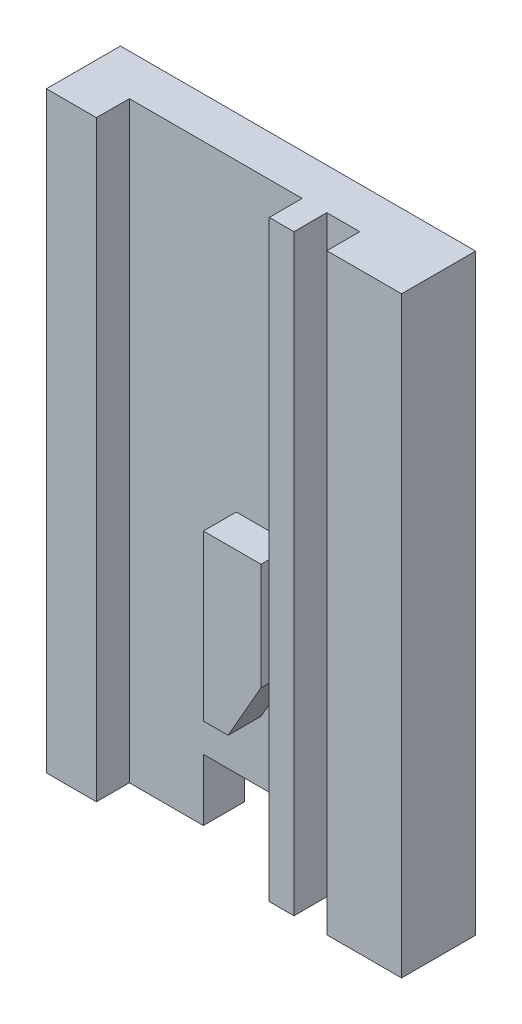
ISO-10303-21;
HEADER;
FILE_DESCRIPTION(('STEP AP214'),'2;1');
FILE_NAME('part.step','',(''),(''),'','','');
FILE_SCHEMA(('AUTOMOTIVE_DESIGN { 1 0 10303 214 1 1 1 1 }'));
ENDSEC;
DATA;
#1=APPLICATION_CONTEXT('core data for automotive mechanical design processes');
#2=APPLICATION_PROTOCOL_DEFINITION('international standard','automotive_design',2000,#1);
#3=PRODUCT_CONTEXT('',#1,'mechanical');
#4=PRODUCT('Part','Part','',(#3));
#5=PRODUCT_RELATED_PRODUCT_CATEGORY('part','',(#4));
#6=PRODUCT_DEFINITION_FORMATION('','',#4);
#7=PRODUCT_DEFINITION_CONTEXT('part definition',#1,'design');
#8=PRODUCT_DEFINITION('design','',#6,#7);
#9=PRODUCT_DEFINITION_SHAPE('','',#8);
#10=(LENGTH_UNIT() NAMED_UNIT(*) SI_UNIT(.MILLI.,.METRE.));
#11=(NAMED_UNIT(*) PLANE_ANGLE_UNIT() SI_UNIT($,.RADIAN.));
#12=(NAMED_UNIT(*) SI_UNIT($,.STERADIAN.) SOLID_ANGLE_UNIT());
#13=UNCERTAINTY_MEASURE_WITH_UNIT(LENGTH_MEASURE(1.E-05),#10,'distance_accuracy_value','');
#14=(GEOMETRIC_REPRESENTATION_CONTEXT(3) GLOBAL_UNCERTAINTY_ASSIGNED_CONTEXT((#13)) GLOBAL_UNIT_ASSIGNED_CONTEXT((#10,
#11,#12)) REPRESENTATION_CONTEXT('',''));
#15=CARTESIAN_POINT('',(0.,0.,0.));
#16=DIRECTION('',(0.,0.,1.));
#17=DIRECTION('',(1.,0.,0.));
#18=AXIS2_PLACEMENT_3D('',#15,#16,#17);
#19=CARTESIAN_POINT('',(1.,-11.,9.));
#20=DIRECTION('',(0.,0.,1.));
#21=DIRECTION('',(1.,0.,0.));
#22=AXIS2_PLACEMENT_3D('',#19,#20,#21);
#23=PLANE('',#22);
#24=DIRECTION('',(0.,1.,0.));
#25=VECTOR('',#24,1.);
#26=CARTESIAN_POINT('',(-2.5,-21.,9.));
#27=LINE('',#26,#25);
#28=CARTESIAN_POINT('',(-2.5,-21.,9.));
#29=VERTEX_POINT('',#28);
#30=CARTESIAN_POINT('',(-2.5,-0.999999999999997,9.));
#31=VERTEX_POINT('',#30);
#32=EDGE_CURVE('E19',#29,#31,#27,.T.);
#33=ORIENTED_EDGE('',*,*,#32,.F.);
#34=DIRECTION('',(1.,0.,0.));
#35=VECTOR('',#34,1.);
#36=CARTESIAN_POINT('',(4.50000000000001,-21.,9.));
#37=LINE('',#36,#35);
#38=CARTESIAN_POINT('',(0.500000000000006,-21.,9.));
#39=VERTEX_POINT('',#38);
#40=EDGE_CURVE('E183',#39,#29,#37,.F.);
#41=ORIENTED_EDGE('',*,*,#40,.F.);
#42=DIRECTION('',(0.496138938356833,0.86824314212446,0.));
#43=VECTOR('',#42,1.);
#44=CARTESIAN_POINT('',(2.5,-17.5,9.));
#45=LINE('',#44,#43);
#46=CARTESIAN_POINT('',(4.5,-14.,9.));
#47=VERTEX_POINT('',#46);
#48=EDGE_CURVE('E175',#47,#39,#45,.F.);
#49=ORIENTED_EDGE('',*,*,#48,.F.);
#50=DIRECTION('',(0.,1.,0.));
#51=VECTOR('',#50,1.);
#52=CARTESIAN_POINT('',(4.5,-0.999999999999996,9.));
#53=LINE('',#52,#51);
#54=CARTESIAN_POINT('',(4.5,-0.999999999999997,9.));
#55=VERTEX_POINT('',#54);
#56=EDGE_CURVE('E169',#55,#47,#53,.F.);
#57=ORIENTED_EDGE('',*,*,#56,.F.);
#58=DIRECTION('',(1.,0.,0.));
#59=VECTOR('',#58,1.);
#60=CARTESIAN_POINT('',(-2.5,-0.999999999999998,9.));
#61=LINE('',#60,#59);
#62=EDGE_CURVE('E151',#31,#55,#61,.T.);
#63=ORIENTED_EDGE('',*,*,#62,.F.);
#64=EDGE_LOOP('',(#33,#41,#49,#57,#63));
#65=FACE_BOUND('',#64,.T.);
#66=ADVANCED_FACE('F16',(#65),#23,.T.);
#67=CARTESIAN_POINT('',(-2.5,-21.,0.));
#68=DIRECTION('',(-1.,0.,0.));
#69=DIRECTION('',(0.,0.,1.));
#70=AXIS2_PLACEMENT_3D('',#67,#68,#69);
#71=PLANE('',#70);
#72=ORIENTED_EDGE('',*,*,#32,.T.);
#73=DIRECTION('',(0.,0.,1.));
#74=VECTOR('',#73,1.);
#75=CARTESIAN_POINT('',(-2.5,-0.999999999999998,0.));
#76=LINE('',#75,#74);
#77=CARTESIAN_POINT('',(-2.5,-0.999999999999998,5.));
#78=VERTEX_POINT('',#77);
#79=EDGE_CURVE('E160',#78,#31,#76,.T.);
#80=ORIENTED_EDGE('',*,*,#79,.F.);
#81=DIRECTION('',(0.,1.,0.));
#82=VECTOR('',#81,1.);
#83=CARTESIAN_POINT('',(-2.5,0.,5.));
#84=LINE('',#83,#82);
#85=CARTESIAN_POINT('',(-2.5,-21.,5.));
#86=VERTEX_POINT('',#85);
#87=EDGE_CURVE('E200',#86,#78,#84,.T.);
#88=ORIENTED_EDGE('',*,*,#87,.F.);
#89=DIRECTION('',(0.,0.,-1.));
#90=VECTOR('',#89,1.);
#91=CARTESIAN_POINT('',(-2.5,-21.,0.));
#92=LINE('',#91,#90);
#93=EDGE_CURVE('E162',#29,#86,#92,.T.);
#94=ORIENTED_EDGE('',*,*,#93,.F.);
#95=EDGE_LOOP('',(#72,#80,#88,#94));
#96=FACE_BOUND('',#95,.T.);
#97=ADVANCED_FACE('F158',(#96),#71,.T.);
#98=CARTESIAN_POINT('',(-2.5,-0.999999999999998,0.));
#99=DIRECTION('',(0.,1.,0.));
#100=DIRECTION('',(0.,0.,1.));
#101=AXIS2_PLACEMENT_3D('',#98,#99,#100);
#102=PLANE('',#101);
#103=ORIENTED_EDGE('',*,*,#62,.T.);
#104=DIRECTION('',(0.,0.,-1.));
#105=VECTOR('',#104,1.);
#106=CARTESIAN_POINT('',(4.5,-0.999999999999996,0.));
#107=LINE('',#106,#105);
#108=CARTESIAN_POINT('',(4.5,-0.999999999999997,5.));
#109=VERTEX_POINT('',#108);
#110=EDGE_CURVE('E170',#109,#55,#107,.F.);
#111=ORIENTED_EDGE('',*,*,#110,.F.);
#112=DIRECTION('',(1.,0.,0.));
#113=VECTOR('',#112,1.);
#114=CARTESIAN_POINT('',(-17.,-0.999999999999998,5.));
#115=LINE('',#114,#113);
#116=EDGE_CURVE('E166',#78,#109,#115,.T.);
#117=ORIENTED_EDGE('',*,*,#116,.F.);
#118=ORIENTED_EDGE('',*,*,#79,.T.);
#119=EDGE_LOOP('',(#103,#111,#117,#118));
#120=FACE_BOUND('',#119,.T.);
#121=ADVANCED_FACE('F165',(#120),#102,.T.);
#122=CARTESIAN_POINT('',(4.5,-0.999999999999996,0.));
#123=DIRECTION('',(1.,0.,0.));
#124=DIRECTION('',(0.,0.,-1.));
#125=AXIS2_PLACEMENT_3D('',#122,#123,#124);
#126=PLANE('',#125);
#127=ORIENTED_EDGE('',*,*,#110,.T.);
#128=ORIENTED_EDGE('',*,*,#56,.T.);
#129=DIRECTION('',(0.,0.,1.));
#130=VECTOR('',#129,1.);
#131=CARTESIAN_POINT('',(4.5,-14.,0.));
#132=LINE('',#131,#130);
#133=CARTESIAN_POINT('',(4.5,-14.,5.));
#134=VERTEX_POINT('',#133);
#135=EDGE_CURVE('E177',#134,#47,#132,.T.);
#136=ORIENTED_EDGE('',*,*,#135,.F.);
#137=DIRECTION('',(0.,1.,0.));
#138=VECTOR('',#137,1.);
#139=CARTESIAN_POINT('',(4.5,0.,5.));
#140=LINE('',#139,#138);
#141=EDGE_CURVE('E203',#109,#134,#140,.F.);
#142=ORIENTED_EDGE('',*,*,#141,.F.);
#143=EDGE_LOOP('',(#127,#128,#136,#142));
#144=FACE_BOUND('',#143,.T.);
#145=ADVANCED_FACE('F400',(#144),#126,.T.);
#146=CARTESIAN_POINT('',(2.5,-17.5,0.));
#147=DIRECTION('',(0.86824314212446,-0.496138938356833,0.));
#148=DIRECTION('',(0.496138938356833,0.86824314212446,0.));
#149=AXIS2_PLACEMENT_3D('',#146,#147,#148);
#150=PLANE('',#149);
#151=DIRECTION('',(-0.496138938356834,-0.868243142124459,0.));
#152=VECTOR('',#151,1.);
#153=CARTESIAN_POINT('',(4.5,-14.,5.));
#154=LINE('',#153,#152);
#155=CARTESIAN_POINT('',(0.500000000000006,-21.,5.));
#156=VERTEX_POINT('',#155);
#157=EDGE_CURVE('E205',#134,#156,#154,.T.);
#158=ORIENTED_EDGE('',*,*,#157,.F.);
#159=ORIENTED_EDGE('',*,*,#135,.T.);
#160=ORIENTED_EDGE('',*,*,#48,.T.);
#161=DIRECTION('',(0.,0.,-1.));
#162=VECTOR('',#161,1.);
#163=CARTESIAN_POINT('',(0.500000000000005,-21.,0.));
#164=LINE('',#163,#162);
#165=EDGE_CURVE('E180',#156,#39,#164,.F.);
#166=ORIENTED_EDGE('',*,*,#165,.F.);
#167=EDGE_LOOP('',(#158,#159,#160,#166));
#168=FACE_BOUND('',#167,.T.);
#169=ADVANCED_FACE('F396',(#168),#150,.T.);
#170=CARTESIAN_POINT('',(4.50000000000001,-21.,0.));
#171=DIRECTION('',(0.,-1.,0.));
#172=DIRECTION('',(0.,0.,-1.));
#173=AXIS2_PLACEMENT_3D('',#170,#171,#172);
#174=PLANE('',#173);
#175=ORIENTED_EDGE('',*,*,#93,.T.);
#176=DIRECTION('',(1.,0.,0.));
#177=VECTOR('',#176,1.);
#178=CARTESIAN_POINT('',(-17.,-21.,5.));
#179=LINE('',#178,#177);
#180=EDGE_CURVE('E207',#156,#86,#179,.F.);
#181=ORIENTED_EDGE('',*,*,#180,.F.);
#182=ORIENTED_EDGE('',*,*,#165,.T.);
#183=ORIENTED_EDGE('',*,*,#40,.T.);
#184=EDGE_LOOP('',(#175,#181,#182,#183));
#185=FACE_BOUND('',#184,.T.);
#186=ADVANCED_FACE('F392',(#185),#174,.T.);
#187=CARTESIAN_POINT('',(9.,0.,9.));
#188=DIRECTION('',(0.,0.,1.));
#189=DIRECTION('',(1.,0.,0.));
#190=AXIS2_PLACEMENT_3D('',#187,#188,#189);
#191=PLANE('',#190);
#192=DIRECTION('',(0.,1.,0.));
#193=VECTOR('',#192,1.);
#194=CARTESIAN_POINT('',(5.50000000000001,-36.,9.));
#195=LINE('',#194,#193);
#196=CARTESIAN_POINT('',(5.50000000000001,-36.,9.));
#197=VERTEX_POINT('',#196);
#198=CARTESIAN_POINT('',(5.5,36.,9.));
#199=VERTEX_POINT('',#198);
#200=EDGE_CURVE('E213',#197,#199,#195,.T.);
#201=ORIENTED_EDGE('',*,*,#200,.F.);
#202=DIRECTION('',(1.,0.,0.));
#203=VECTOR('',#202,1.);
#204=CARTESIAN_POINT('',(12.5,-36.,9.));
#205=LINE('',#204,#203);
#206=CARTESIAN_POINT('',(8.50000000000001,-36.,9.));
#207=VERTEX_POINT('',#206);
#208=EDGE_CURVE('E233',#207,#197,#205,.F.);
#209=ORIENTED_EDGE('',*,*,#208,.F.);
#210=DIRECTION('',(0.,1.,0.));
#211=VECTOR('',#210,1.);
#212=CARTESIAN_POINT('',(8.50000000000001,-36.,9.));
#213=LINE('',#212,#211);
#214=CARTESIAN_POINT('',(8.5,36.,9.));
#215=VERTEX_POINT('',#214);
#216=EDGE_CURVE('E186',#207,#215,#213,.T.);
#217=ORIENTED_EDGE('',*,*,#216,.T.);
#218=DIRECTION('',(1.,0.,0.));
#219=VECTOR('',#218,1.);
#220=CARTESIAN_POINT('',(-18.5,36.,9.));
#221=LINE('',#220,#219);
#222=EDGE_CURVE('E250',#199,#215,#221,.T.);
#223=ORIENTED_EDGE('',*,*,#222,.F.);
#224=EDGE_LOOP('',(#201,#209,#217,#223));
#225=FACE_BOUND('',#224,.T.);
#226=ADVANCED_FACE('F388',(#225),#191,.T.);
#227=CARTESIAN_POINT('',(8.50000000000001,-36.,0.));
#228=DIRECTION('',(-1.,0.,0.));
#229=DIRECTION('',(0.,0.,1.));
#230=AXIS2_PLACEMENT_3D('',#227,#228,#229);
#231=PLANE('',#230);
#232=DIRECTION('',(0.,0.,1.));
#233=VECTOR('',#232,1.);
#234=CARTESIAN_POINT('',(8.49999999999999,36.,0.));
#235=LINE('',#234,#233);
#236=CARTESIAN_POINT('',(8.5,36.,5.));
#237=VERTEX_POINT('',#236);
#238=EDGE_CURVE('E252',#215,#237,#235,.F.);
#239=ORIENTED_EDGE('',*,*,#238,.F.);
#240=ORIENTED_EDGE('',*,*,#216,.F.);
#241=DIRECTION('',(0.,0.,-1.));
#242=VECTOR('',#241,1.);
#243=CARTESIAN_POINT('',(8.50000000000001,-36.,0.));
#244=LINE('',#243,#242);
#245=CARTESIAN_POINT('',(8.5,-36.,5.));
#246=VERTEX_POINT('',#245);
#247=EDGE_CURVE('E230',#246,#207,#244,.F.);
#248=ORIENTED_EDGE('',*,*,#247,.F.);
#249=DIRECTION('',(0.,1.,0.));
#250=VECTOR('',#249,1.);
#251=CARTESIAN_POINT('',(8.49999999999999,0.,5.));
#252=LINE('',#251,#250);
#253=EDGE_CURVE('E189',#237,#246,#252,.F.);
#254=ORIENTED_EDGE('',*,*,#253,.F.);
#255=EDGE_LOOP('',(#239,#240,#248,#254));
#256=FACE_BOUND('',#255,.T.);
#257=ADVANCED_FACE('F384',(#256),#231,.F.);
#258=CARTESIAN_POINT('',(-17.,0.,5.));
#259=DIRECTION('',(0.,0.,1.));
#260=DIRECTION('',(1.,0.,0.));
#261=AXIS2_PLACEMENT_3D('',#258,#259,#260);
#262=PLANE('',#261);
#263=ORIENTED_EDGE('',*,*,#253,.T.);
#264=DIRECTION('',(1.,0.,0.));
#265=VECTOR('',#264,1.);
#266=CARTESIAN_POINT('',(12.5,-36.,5.));
#267=LINE('',#266,#265);
#268=CARTESIAN_POINT('',(12.5,-36.,5.));
#269=VERTEX_POINT('',#268);
#270=EDGE_CURVE('E227',#269,#246,#267,.F.);
#271=ORIENTED_EDGE('',*,*,#270,.F.);
#272=DIRECTION('',(0.,1.,0.));
#273=VECTOR('',#272,1.);
#274=CARTESIAN_POINT('',(12.5,36.,5.));
#275=LINE('',#274,#273);
#276=CARTESIAN_POINT('',(12.5,36.,5.));
#277=VERTEX_POINT('',#276);
#278=EDGE_CURVE('E191',#269,#277,#275,.T.);
#279=ORIENTED_EDGE('',*,*,#278,.T.);
#280=DIRECTION('',(1.,0.,0.));
#281=VECTOR('',#280,1.);
#282=CARTESIAN_POINT('',(-18.5,36.,5.));
#283=LINE('',#282,#281);
#284=EDGE_CURVE('E254',#237,#277,#283,.T.);
#285=ORIENTED_EDGE('',*,*,#284,.F.);
#286=EDGE_LOOP('',(#263,#271,#279,#285));
#287=FACE_BOUND('',#286,.T.);
#288=ADVANCED_FACE('F380',(#287),#262,.T.);
#289=CARTESIAN_POINT('',(12.5,36.,0.));
#290=DIRECTION('',(1.,0.,0.));
#291=DIRECTION('',(0.,0.,-1.));
#292=AXIS2_PLACEMENT_3D('',#289,#290,#291);
#293=PLANE('',#292);
#294=DIRECTION('',(0.,0.,-1.));
#295=VECTOR('',#294,1.);
#296=CARTESIAN_POINT('',(12.5,-36.,0.));
#297=LINE('',#296,#295);
#298=CARTESIAN_POINT('',(12.5,-36.,9.));
#299=VERTEX_POINT('',#298);
#300=EDGE_CURVE('E224',#299,#269,#297,.T.);
#301=ORIENTED_EDGE('',*,*,#300,.F.);
#302=DIRECTION('',(0.,1.,0.));
#303=VECTOR('',#302,1.);
#304=CARTESIAN_POINT('',(12.5,0.,9.));
#305=LINE('',#304,#303);
#306=CARTESIAN_POINT('',(12.5,36.,9.));
#307=VERTEX_POINT('',#306);
#308=EDGE_CURVE('E194',#307,#299,#305,.F.);
#309=ORIENTED_EDGE('',*,*,#308,.F.);
#310=DIRECTION('',(0.,0.,1.));
#311=VECTOR('',#310,1.);
#312=CARTESIAN_POINT('',(12.5,36.,0.));
#313=LINE('',#312,#311);
#314=EDGE_CURVE('E256',#277,#307,#313,.T.);
#315=ORIENTED_EDGE('',*,*,#314,.F.);
#316=ORIENTED_EDGE('',*,*,#278,.F.);
#317=EDGE_LOOP('',(#301,#309,#315,#316));
#318=FACE_BOUND('',#317,.T.);
#319=ADVANCED_FACE('F376',(#318),#293,.F.);
#320=CARTESIAN_POINT('',(13.5,0.,9.));
#321=DIRECTION('',(0.,0.,1.));
#322=DIRECTION('',(1.,0.,0.));
#323=AXIS2_PLACEMENT_3D('',#320,#321,#322);
#324=PLANE('',#323);
#325=DIRECTION('',(0.,1.,0.));
#326=VECTOR('',#325,1.);
#327=CARTESIAN_POINT('',(21.58,36.,9.));
#328=LINE('',#327,#326);
#329=CARTESIAN_POINT('',(21.58,36.,9.));
#330=VERTEX_POINT('',#329);
#331=CARTESIAN_POINT('',(21.58,-36.,9.));
#332=VERTEX_POINT('',#331);
#333=EDGE_CURVE('E236',#330,#332,#328,.F.);
#334=ORIENTED_EDGE('',*,*,#333,.F.);
#335=DIRECTION('',(1.,0.,0.));
#336=VECTOR('',#335,1.);
#337=CARTESIAN_POINT('',(-18.5,36.,9.));
#338=LINE('',#337,#336);
#339=EDGE_CURVE('E258',#307,#330,#338,.T.);
#340=ORIENTED_EDGE('',*,*,#339,.F.);
#341=ORIENTED_EDGE('',*,*,#308,.T.);
#342=DIRECTION('',(1.,0.,0.));
#343=VECTOR('',#342,1.);
#344=CARTESIAN_POINT('',(12.5,-36.,9.));
#345=LINE('',#344,#343);
#346=EDGE_CURVE('E221',#332,#299,#345,.F.);
#347=ORIENTED_EDGE('',*,*,#346,.F.);
#348=EDGE_LOOP('',(#334,#340,#341,#347));
#349=FACE_BOUND('',#348,.T.);
#350=ADVANCED_FACE('F372',(#349),#324,.T.);
#351=CARTESIAN_POINT('',(-15.5,36.,0.));
#352=DIRECTION('',(1.,0.,0.));
#353=DIRECTION('',(0.,0.,-1.));
#354=AXIS2_PLACEMENT_3D('',#351,#352,#353);
#355=PLANE('',#354);
#356=DIRECTION('',(0.,1.,0.));
#357=VECTOR('',#356,1.);
#358=CARTESIAN_POINT('',(-15.5,0.,9.));
#359=LINE('',#358,#357);
#360=CARTESIAN_POINT('',(-15.5,-36.,9.));
#361=VERTEX_POINT('',#360);
#362=CARTESIAN_POINT('',(-15.5,36.,9.));
#363=VERTEX_POINT('',#362);
#364=EDGE_CURVE('E196',#361,#363,#359,.T.);
#365=ORIENTED_EDGE('',*,*,#364,.F.);
#366=DIRECTION('',(0.,0.,-1.));
#367=VECTOR('',#366,1.);
#368=CARTESIAN_POINT('',(-15.5,-36.,0.));
#369=LINE('',#368,#367);
#370=CARTESIAN_POINT('',(-15.5,-36.,5.));
#371=VERTEX_POINT('',#370);
#372=EDGE_CURVE('E269',#371,#361,#369,.F.);
#373=ORIENTED_EDGE('',*,*,#372,.F.);
#374=DIRECTION('',(0.,1.,0.));
#375=VECTOR('',#374,1.);
#376=CARTESIAN_POINT('',(-15.5,0.,5.));
#377=LINE('',#376,#375);
#378=CARTESIAN_POINT('',(-15.5,36.,5.));
#379=VERTEX_POINT('',#378);
#380=EDGE_CURVE('E198',#379,#371,#377,.F.);
#381=ORIENTED_EDGE('',*,*,#380,.F.);
#382=DIRECTION('',(0.,0.,1.));
#383=VECTOR('',#382,1.);
#384=CARTESIAN_POINT('',(-15.5,36.,0.));
#385=LINE('',#384,#383);
#386=EDGE_CURVE('E243',#363,#379,#385,.F.);
#387=ORIENTED_EDGE('',*,*,#386,.F.);
#388=EDGE_LOOP('',(#365,#373,#381,#387));
#389=FACE_BOUND('',#388,.T.);
#390=ADVANCED_FACE('F368',(#389),#355,.T.);
#391=CARTESIAN_POINT('',(-17.,0.,9.));
#392=DIRECTION('',(0.,0.,1.));
#393=DIRECTION('',(1.,0.,0.));
#394=AXIS2_PLACEMENT_3D('',#391,#392,#393);
#395=PLANE('',#394);
#396=DIRECTION('',(1.,0.,0.));
#397=VECTOR('',#396,1.);
#398=CARTESIAN_POINT('',(12.5,-36.,9.));
#399=LINE('',#398,#397);
#400=CARTESIAN_POINT('',(-21.58,-36.,9.));
#401=VERTEX_POINT('',#400);
#402=EDGE_CURVE('E271',#361,#401,#399,.F.);
#403=ORIENTED_EDGE('',*,*,#402,.F.);
#404=ORIENTED_EDGE('',*,*,#364,.T.);
#405=DIRECTION('',(1.,0.,0.));
#406=VECTOR('',#405,1.);
#407=CARTESIAN_POINT('',(-18.5,36.,9.));
#408=LINE('',#407,#406);
#409=CARTESIAN_POINT('',(-21.58,36.,9.));
#410=VERTEX_POINT('',#409);
#411=EDGE_CURVE('E240',#410,#363,#408,.T.);
#412=ORIENTED_EDGE('',*,*,#411,.F.);
#413=DIRECTION('',(0.,1.,0.));
#414=VECTOR('',#413,1.);
#415=CARTESIAN_POINT('',(-21.58,-36.,9.));
#416=LINE('',#415,#414);
#417=EDGE_CURVE('E262',#401,#410,#416,.T.);
#418=ORIENTED_EDGE('',*,*,#417,.F.);
#419=EDGE_LOOP('',(#403,#404,#412,#418));
#420=FACE_BOUND('',#419,.T.);
#421=ADVANCED_FACE('F364',(#420),#395,.T.);
#422=CARTESIAN_POINT('',(-17.,0.,5.));
#423=DIRECTION('',(0.,0.,1.));
#424=DIRECTION('',(1.,0.,0.));
#425=AXIS2_PLACEMENT_3D('',#422,#423,#424);
#426=PLANE('',#425);
#427=ORIENTED_EDGE('',*,*,#157,.T.);
#428=ORIENTED_EDGE('',*,*,#180,.T.);
#429=ORIENTED_EDGE('',*,*,#87,.T.);
#430=ORIENTED_EDGE('',*,*,#116,.T.);
#431=ORIENTED_EDGE('',*,*,#141,.T.);
#432=EDGE_LOOP('',(#427,#428,#429,#430,#431));
#433=FACE_BOUND('',#432,.T.);
#434=DIRECTION('',(1.,0.,0.));
#435=VECTOR('',#434,1.);
#436=CARTESIAN_POINT('',(12.5,-36.,5.));
#437=LINE('',#436,#435);
#438=CARTESIAN_POINT('',(-6.49999999999999,-36.,5.));
#439=VERTEX_POINT('',#438);
#440=EDGE_CURVE('E266',#439,#371,#437,.F.);
#441=ORIENTED_EDGE('',*,*,#440,.F.);
#442=DIRECTION('',(0.,1.,0.));
#443=VECTOR('',#442,1.);
#444=CARTESIAN_POINT('',(-6.49999999999999,-28.5,5.));
#445=LINE('',#444,#443);
#446=CARTESIAN_POINT('',(-6.49999999999999,-28.5,5.));
#447=VERTEX_POINT('',#446);
#448=EDGE_CURVE('E276',#439,#447,#445,.T.);
#449=ORIENTED_EDGE('',*,*,#448,.T.);
#450=DIRECTION('',(1.,0.,0.));
#451=VECTOR('',#450,1.);
#452=CARTESIAN_POINT('',(5.50000000000001,-28.5,5.));
#453=LINE('',#452,#451);
#454=CARTESIAN_POINT('',(5.50000000000001,-28.5,5.));
#455=VERTEX_POINT('',#454);
#456=EDGE_CURVE('E210',#447,#455,#453,.T.);
#457=ORIENTED_EDGE('',*,*,#456,.T.);
#458=DIRECTION('',(0.,1.,0.));
#459=VECTOR('',#458,1.);
#460=CARTESIAN_POINT('',(5.50000000000001,-36.,5.));
#461=LINE('',#460,#459);
#462=CARTESIAN_POINT('',(5.5,36.,5.));
#463=VERTEX_POINT('',#462);
#464=EDGE_CURVE('E215',#463,#455,#461,.F.);
#465=ORIENTED_EDGE('',*,*,#464,.F.);
#466=DIRECTION('',(1.,0.,0.));
#467=VECTOR('',#466,1.);
#468=CARTESIAN_POINT('',(-18.5,36.,5.));
#469=LINE('',#468,#467);
#470=EDGE_CURVE('E245',#379,#463,#469,.T.);
#471=ORIENTED_EDGE('',*,*,#470,.F.);
#472=ORIENTED_EDGE('',*,*,#380,.T.);
#473=EDGE_LOOP('',(#441,#449,#457,#465,#471,#472));
#474=FACE_BOUND('',#473,.T.);
#475=ADVANCED_FACE('F361',(#433,#474),#426,.T.);
#476=CARTESIAN_POINT('',(5.50000000000001,-28.5,5.));
#477=DIRECTION('',(0.,1.,0.));
#478=DIRECTION('',(0.,0.,1.));
#479=AXIS2_PLACEMENT_3D('',#476,#477,#478);
#480=PLANE('',#479);
#481=DIRECTION('',(0.,0.,1.));
#482=VECTOR('',#481,1.);
#483=CARTESIAN_POINT('',(5.50000000000001,-28.5,0.));
#484=LINE('',#483,#482);
#485=CARTESIAN_POINT('',(5.50000000000001,-28.5,0.));
#486=VERTEX_POINT('',#485);
#487=EDGE_CURVE('E217',#455,#486,#484,.F.);
#488=ORIENTED_EDGE('',*,*,#487,.F.);
#489=ORIENTED_EDGE('',*,*,#456,.F.);
#490=DIRECTION('',(0.,0.,1.));
#491=VECTOR('',#490,1.);
#492=CARTESIAN_POINT('',(-6.49999999999999,-28.5,5.));
#493=LINE('',#492,#491);
#494=CARTESIAN_POINT('',(-6.49999999999999,-28.5,0.));
#495=VERTEX_POINT('',#494);
#496=EDGE_CURVE('E279',#447,#495,#493,.F.);
#497=ORIENTED_EDGE('',*,*,#496,.T.);
#498=DIRECTION('',(1.,0.,0.));
#499=VECTOR('',#498,1.);
#500=CARTESIAN_POINT('',(-17.,-28.5,0.));
#501=LINE('',#500,#499);
#502=EDGE_CURVE('E282',#495,#486,#501,.T.);
#503=ORIENTED_EDGE('',*,*,#502,.T.);
#504=EDGE_LOOP('',(#488,#489,#497,#503));
#505=FACE_BOUND('',#504,.T.);
#506=ADVANCED_FACE('F336',(#505),#480,.F.);
#507=CARTESIAN_POINT('',(5.50000000000001,-36.,0.));
#508=DIRECTION('',(-1.,0.,0.));
#509=DIRECTION('',(0.,0.,1.));
#510=AXIS2_PLACEMENT_3D('',#507,#508,#509);
#511=PLANE('',#510);
#512=ORIENTED_EDGE('',*,*,#487,.T.);
#513=DIRECTION('',(0.,1.,0.));
#514=VECTOR('',#513,1.);
#515=CARTESIAN_POINT('',(5.50000000000001,0.,0.));
#516=LINE('',#515,#514);
#517=CARTESIAN_POINT('',(5.50000000000001,-36.,0.));
#518=VERTEX_POINT('',#517);
#519=EDGE_CURVE('E285',#486,#518,#516,.F.);
#520=ORIENTED_EDGE('',*,*,#519,.T.);
#521=DIRECTION('',(0.,0.,-1.));
#522=VECTOR('',#521,1.);
#523=CARTESIAN_POINT('',(5.50000000000001,-36.,0.));
#524=LINE('',#523,#522);
#525=EDGE_CURVE('E219',#197,#518,#524,.T.);
#526=ORIENTED_EDGE('',*,*,#525,.F.);
#527=ORIENTED_EDGE('',*,*,#200,.T.);
#528=DIRECTION('',(0.,0.,1.));
#529=VECTOR('',#528,1.);
#530=CARTESIAN_POINT('',(5.49999999999999,36.,0.));
#531=LINE('',#530,#529);
#532=EDGE_CURVE('E247',#463,#199,#531,.T.);
#533=ORIENTED_EDGE('',*,*,#532,.F.);
#534=ORIENTED_EDGE('',*,*,#464,.T.);
#535=EDGE_LOOP('',(#512,#520,#526,#527,#533,#534));
#536=FACE_BOUND('',#535,.T.);
#537=ADVANCED_FACE('F331',(#536),#511,.T.);
#538=CARTESIAN_POINT('',(12.5,-36.,0.));
#539=DIRECTION('',(0.,-1.,0.));
#540=DIRECTION('',(0.,0.,-1.));
#541=AXIS2_PLACEMENT_3D('',#538,#539,#540);
#542=PLANE('',#541);
#543=ORIENTED_EDGE('',*,*,#247,.T.);
#544=ORIENTED_EDGE('',*,*,#208,.T.);
#545=ORIENTED_EDGE('',*,*,#525,.T.);
#546=DIRECTION('',(1.,0.,0.));
#547=VECTOR('',#546,1.);
#548=CARTESIAN_POINT('',(-17.,-36.,0.));
#549=LINE('',#548,#547);
#550=CARTESIAN_POINT('',(21.58,-36.,0.));
#551=VERTEX_POINT('',#550);
#552=EDGE_CURVE('E288',#518,#551,#549,.T.);
#553=ORIENTED_EDGE('',*,*,#552,.T.);
#554=DIRECTION('',(0.,0.,-1.));
#555=VECTOR('',#554,1.);
#556=CARTESIAN_POINT('',(21.58,-36.,0.));
#557=LINE('',#556,#555);
#558=EDGE_CURVE('E238',#332,#551,#557,.T.);
#559=ORIENTED_EDGE('',*,*,#558,.F.);
#560=ORIENTED_EDGE('',*,*,#346,.T.);
#561=ORIENTED_EDGE('',*,*,#300,.T.);
#562=ORIENTED_EDGE('',*,*,#270,.T.);
#563=EDGE_LOOP('',(#543,#544,#545,#553,#559,#560,#561,#562));
#564=FACE_BOUND('',#563,.T.);
#565=ADVANCED_FACE('F326',(#564),#542,.T.);
#566=CARTESIAN_POINT('',(21.58,36.,0.));
#567=DIRECTION('',(1.,0.,0.));
#568=DIRECTION('',(0.,0.,-1.));
#569=AXIS2_PLACEMENT_3D('',#566,#567,#568);
#570=PLANE('',#569);
#571=DIRECTION('',(0.,1.,0.));
#572=VECTOR('',#571,1.);
#573=CARTESIAN_POINT('',(21.58,0.,0.));
#574=LINE('',#573,#572);
#575=CARTESIAN_POINT('',(21.58,36.,0.));
#576=VERTEX_POINT('',#575);
#577=EDGE_CURVE('E291',#551,#576,#574,.T.);
#578=ORIENTED_EDGE('',*,*,#577,.T.);
#579=DIRECTION('',(0.,0.,1.));
#580=VECTOR('',#579,1.);
#581=CARTESIAN_POINT('',(21.58,36.,0.));
#582=LINE('',#581,#580);
#583=EDGE_CURVE('E260',#330,#576,#582,.F.);
#584=ORIENTED_EDGE('',*,*,#583,.F.);
#585=ORIENTED_EDGE('',*,*,#333,.T.);
#586=ORIENTED_EDGE('',*,*,#558,.T.);
#587=EDGE_LOOP('',(#578,#584,#585,#586));
#588=FACE_BOUND('',#587,.T.);
#589=ADVANCED_FACE('F321',(#588),#570,.T.);
#590=CARTESIAN_POINT('',(-18.5,36.,0.));
#591=DIRECTION('',(0.,1.,0.));
#592=DIRECTION('',(0.,0.,1.));
#593=AXIS2_PLACEMENT_3D('',#590,#591,#592);
#594=PLANE('',#593);
#595=ORIENTED_EDGE('',*,*,#339,.T.);
#596=ORIENTED_EDGE('',*,*,#583,.T.);
#597=DIRECTION('',(1.,0.,0.));
#598=VECTOR('',#597,1.);
#599=CARTESIAN_POINT('',(-17.,36.,0.));
#600=LINE('',#599,#598);
#601=CARTESIAN_POINT('',(-21.58,36.,0.));
#602=VERTEX_POINT('',#601);
#603=EDGE_CURVE('E294',#576,#602,#600,.F.);
#604=ORIENTED_EDGE('',*,*,#603,.T.);
#605=DIRECTION('',(0.,0.,1.));
#606=VECTOR('',#605,1.);
#607=CARTESIAN_POINT('',(-21.58,36.,0.));
#608=LINE('',#607,#606);
#609=EDGE_CURVE('E264',#410,#602,#608,.F.);
#610=ORIENTED_EDGE('',*,*,#609,.F.);
#611=ORIENTED_EDGE('',*,*,#411,.T.);
#612=ORIENTED_EDGE('',*,*,#386,.T.);
#613=ORIENTED_EDGE('',*,*,#470,.T.);
#614=ORIENTED_EDGE('',*,*,#532,.T.);
#615=ORIENTED_EDGE('',*,*,#222,.T.);
#616=ORIENTED_EDGE('',*,*,#238,.T.);
#617=ORIENTED_EDGE('',*,*,#284,.T.);
#618=ORIENTED_EDGE('',*,*,#314,.T.);
#619=EDGE_LOOP('',(#595,#596,#604,#610,#611,#612,#613,#614,#615,#616,#617,#618));
#620=FACE_BOUND('',#619,.T.);
#621=ADVANCED_FACE('F315',(#620),#594,.T.);
#622=CARTESIAN_POINT('',(-21.58,-36.,0.));
#623=DIRECTION('',(-1.,0.,0.));
#624=DIRECTION('',(0.,0.,1.));
#625=AXIS2_PLACEMENT_3D('',#622,#623,#624);
#626=PLANE('',#625);
#627=DIRECTION('',(0.,1.,0.));
#628=VECTOR('',#627,1.);
#629=CARTESIAN_POINT('',(-21.58,0.,0.));
#630=LINE('',#629,#628);
#631=CARTESIAN_POINT('',(-21.58,-36.,0.));
#632=VERTEX_POINT('',#631);
#633=EDGE_CURVE('E297',#602,#632,#630,.F.);
#634=ORIENTED_EDGE('',*,*,#633,.T.);
#635=DIRECTION('',(0.,0.,-1.));
#636=VECTOR('',#635,1.);
#637=CARTESIAN_POINT('',(-21.58,-36.,0.));
#638=LINE('',#637,#636);
#639=EDGE_CURVE('E273',#401,#632,#638,.T.);
#640=ORIENTED_EDGE('',*,*,#639,.F.);
#641=ORIENTED_EDGE('',*,*,#417,.T.);
#642=ORIENTED_EDGE('',*,*,#609,.T.);
#643=EDGE_LOOP('',(#634,#640,#641,#642));
#644=FACE_BOUND('',#643,.T.);
#645=ADVANCED_FACE('F310',(#644),#626,.T.);
#646=CARTESIAN_POINT('',(12.5,-36.,0.));
#647=DIRECTION('',(0.,-1.,0.));
#648=DIRECTION('',(0.,0.,-1.));
#649=AXIS2_PLACEMENT_3D('',#646,#647,#648);
#650=PLANE('',#649);
#651=ORIENTED_EDGE('',*,*,#639,.T.);
#652=DIRECTION('',(1.,0.,0.));
#653=VECTOR('',#652,1.);
#654=CARTESIAN_POINT('',(-17.,-36.,0.));
#655=LINE('',#654,#653);
#656=CARTESIAN_POINT('',(-6.49999999999999,-36.,0.));
#657=VERTEX_POINT('',#656);
#658=EDGE_CURVE('E25',#632,#657,#655,.T.);
#659=ORIENTED_EDGE('',*,*,#658,.T.);
#660=DIRECTION('',(0.,0.,1.));
#661=VECTOR('',#660,1.);
#662=CARTESIAN_POINT('',(-6.49999999999999,-36.,5.));
#663=LINE('',#662,#661);
#664=EDGE_CURVE('E33',#657,#439,#663,.T.);
#665=ORIENTED_EDGE('',*,*,#664,.T.);
#666=ORIENTED_EDGE('',*,*,#440,.T.);
#667=ORIENTED_EDGE('',*,*,#372,.T.);
#668=ORIENTED_EDGE('',*,*,#402,.T.);
#669=EDGE_LOOP('',(#651,#659,#665,#666,#667,#668));
#670=FACE_BOUND('',#669,.T.);
#671=ADVANCED_FACE('F303',(#670),#650,.T.);
#672=CARTESIAN_POINT('',(-6.49999999999999,-28.5,5.));
#673=DIRECTION('',(-1.,0.,0.));
#674=DIRECTION('',(0.,0.,1.));
#675=AXIS2_PLACEMENT_3D('',#672,#673,#674);
#676=PLANE('',#675);
#677=ORIENTED_EDGE('',*,*,#496,.F.);
#678=ORIENTED_EDGE('',*,*,#448,.F.);
#679=ORIENTED_EDGE('',*,*,#664,.F.);
#680=DIRECTION('',(0.,1.,0.));
#681=VECTOR('',#680,1.);
#682=CARTESIAN_POINT('',(-6.49999999999999,0.,0.));
#683=LINE('',#682,#681);
#684=EDGE_CURVE('E11',#657,#495,#683,.T.);
#685=ORIENTED_EDGE('',*,*,#684,.T.);
#686=EDGE_LOOP('',(#677,#678,#679,#685));
#687=FACE_BOUND('',#686,.T.);
#688=ADVANCED_FACE('F338',(#687),#676,.F.);
#689=CARTESIAN_POINT('',(-17.,0.,0.));
#690=DIRECTION('',(0.,0.,1.));
#691=DIRECTION('',(1.,0.,0.));
#692=AXIS2_PLACEMENT_3D('',#689,#690,#691);
#693=PLANE('',#692);
#694=ORIENTED_EDGE('',*,*,#658,.F.);
#695=ORIENTED_EDGE('',*,*,#633,.F.);
#696=ORIENTED_EDGE('',*,*,#603,.F.);
#697=ORIENTED_EDGE('',*,*,#577,.F.);
#698=ORIENTED_EDGE('',*,*,#552,.F.);
#699=ORIENTED_EDGE('',*,*,#519,.F.);
#700=ORIENTED_EDGE('',*,*,#502,.F.);
#701=ORIENTED_EDGE('',*,*,#684,.F.);
#702=EDGE_LOOP('',(#694,#695,#696,#697,#698,#699,#700,#701));
#703=FACE_BOUND('',#702,.T.);
#704=ADVANCED_FACE('F307',(#703),#693,.F.);
#705=CLOSED_SHELL('',(#66,#97,#121,#145,#169,#186,#226,#257,#288,#319,#350,#390,#421,#475,#506,
#537,#565,#589,#621,#645,#671,#688,#704));
#706=MANIFOLD_SOLID_BREP('B1',#705);
#707=ADVANCED_BREP_SHAPE_REPRESENTATION('',(#18,#706),#14);
#708=SHAPE_DEFINITION_REPRESENTATION(#9,#707);
ENDSEC;
END-ISO-10303-21;
